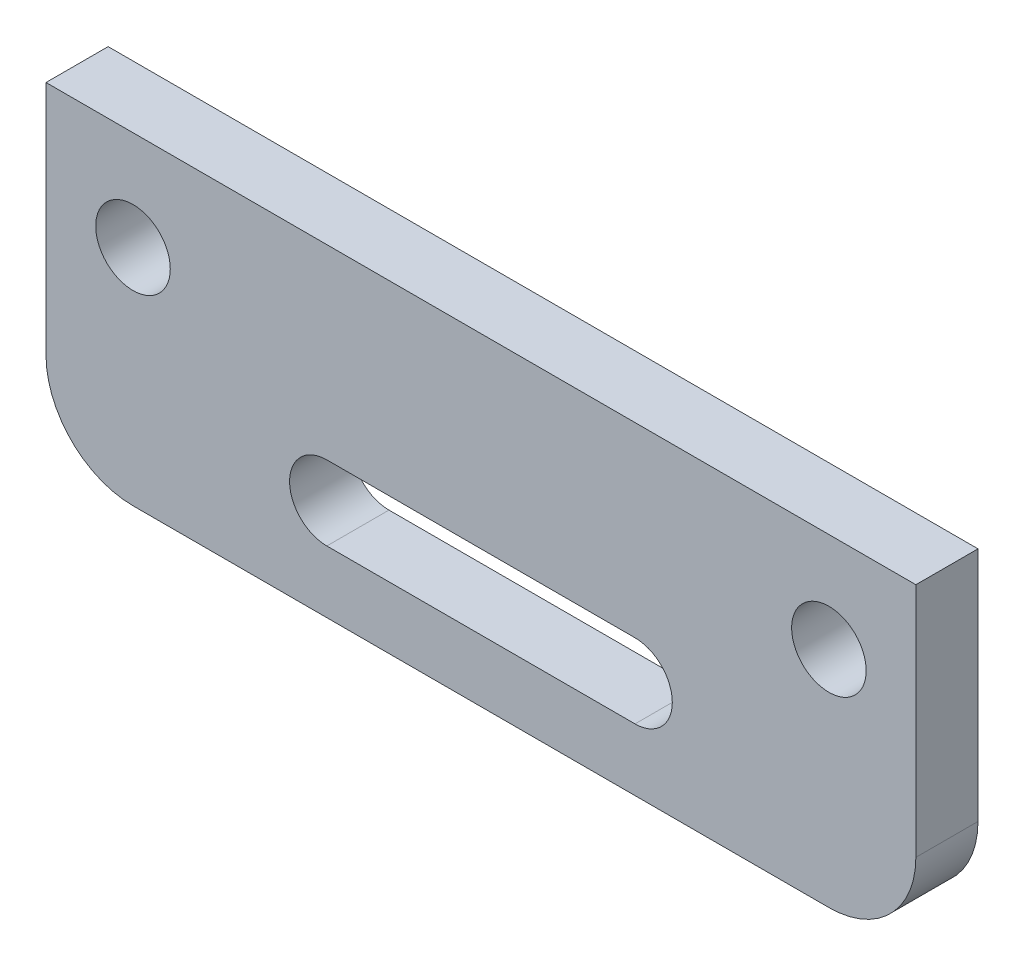
ISO-10303-21;
HEADER;
FILE_DESCRIPTION(('STEP AP214'),'2;1');
FILE_NAME('part.step','',(''),(''),'','','');
FILE_SCHEMA(('AUTOMOTIVE_DESIGN { 1 0 10303 214 1 1 1 1 }'));
ENDSEC;
DATA;
#1=APPLICATION_CONTEXT('core data for automotive mechanical design processes');
#2=APPLICATION_PROTOCOL_DEFINITION('international standard','automotive_design',2000,#1);
#3=PRODUCT_CONTEXT('',#1,'mechanical');
#4=PRODUCT('Part','Part','',(#3));
#5=PRODUCT_RELATED_PRODUCT_CATEGORY('part','',(#4));
#6=PRODUCT_DEFINITION_FORMATION('','',#4);
#7=PRODUCT_DEFINITION_CONTEXT('part definition',#1,'design');
#8=PRODUCT_DEFINITION('design','',#6,#7);
#9=PRODUCT_DEFINITION_SHAPE('','',#8);
#10=(LENGTH_UNIT() NAMED_UNIT(*) SI_UNIT(.MILLI.,.METRE.));
#11=(NAMED_UNIT(*) PLANE_ANGLE_UNIT() SI_UNIT($,.RADIAN.));
#12=(NAMED_UNIT(*) SI_UNIT($,.STERADIAN.) SOLID_ANGLE_UNIT());
#13=UNCERTAINTY_MEASURE_WITH_UNIT(LENGTH_MEASURE(1.E-05),#10,'distance_accuracy_value','');
#14=(GEOMETRIC_REPRESENTATION_CONTEXT(3) GLOBAL_UNCERTAINTY_ASSIGNED_CONTEXT((#13)) GLOBAL_UNIT_ASSIGNED_CONTEXT((#10,
#11,#12)) REPRESENTATION_CONTEXT('',''));
#15=CARTESIAN_POINT('',(0.,0.,0.));
#16=DIRECTION('',(0.,0.,1.));
#17=DIRECTION('',(1.,0.,0.));
#18=AXIS2_PLACEMENT_3D('',#15,#16,#17);
#19=CARTESIAN_POINT('',(0.,8.49264705882353,2.5));
#20=DIRECTION('',(0.,0.,-1.));
#21=DIRECTION('',(-1.,0.,0.));
#22=AXIS2_PLACEMENT_3D('',#19,#20,#21);
#23=PLANE('',#22);
#24=CARTESIAN_POINT('',(-14.,-10.,2.5));
#25=DIRECTION('',(0.,0.,1.));
#26=DIRECTION('',(1.,0.,0.));
#27=AXIS2_PLACEMENT_3D('',#24,#25,#26);
#28=CIRCLE('',#27,1.5);
#29=CARTESIAN_POINT('',(-12.5,-10.,2.5));
#30=VERTEX_POINT('',#29);
#31=EDGE_CURVE('E169',#30,#30,#28,.T.);
#32=ORIENTED_EDGE('',*,*,#31,.F.);
#33=EDGE_LOOP('',(#32));
#34=FACE_BOUND('',#33,.T.);
#35=DIRECTION('',(0.,1.,0.));
#36=VECTOR('',#35,1.);
#37=CARTESIAN_POINT('',(17.5,9.00000000000001,2.5));
#38=LINE('',#37,#36);
#39=CARTESIAN_POINT('',(17.5,-15.5,2.5));
#40=VERTEX_POINT('',#39);
#41=CARTESIAN_POINT('',(17.5,-6.,2.5));
#42=VERTEX_POINT('',#41);
#43=EDGE_CURVE('E111',#40,#42,#38,.T.);
#44=ORIENTED_EDGE('',*,*,#43,.T.);
#45=DIRECTION('',(1.,0.,0.));
#46=VECTOR('',#45,1.);
#47=CARTESIAN_POINT('',(-11.5,-6.,2.5));
#48=LINE('',#47,#46);
#49=CARTESIAN_POINT('',(-17.5,-6.,2.5));
#50=VERTEX_POINT('',#49);
#51=EDGE_CURVE('E108',#50,#42,#48,.T.);
#52=ORIENTED_EDGE('',*,*,#51,.F.);
#53=DIRECTION('',(0.,-1.,0.));
#54=VECTOR('',#53,1.);
#55=CARTESIAN_POINT('',(-17.5,9.00000000000001,2.5));
#56=LINE('',#55,#54);
#57=CARTESIAN_POINT('',(-17.5,-15.5,2.5));
#58=VERTEX_POINT('',#57);
#59=EDGE_CURVE('E55',#50,#58,#56,.T.);
#60=ORIENTED_EDGE('',*,*,#59,.T.);
#61=CARTESIAN_POINT('',(-14.,-15.5,2.5));
#62=DIRECTION('',(0.,0.,-1.));
#63=DIRECTION('',(-1.,0.,0.));
#64=AXIS2_PLACEMENT_3D('',#61,#62,#63);
#65=CIRCLE('',#64,3.5);
#66=CARTESIAN_POINT('',(-14.,-19.,2.5));
#67=VERTEX_POINT('',#66);
#68=EDGE_CURVE('E41',#58,#67,#65,.F.);
#69=ORIENTED_EDGE('',*,*,#68,.T.);
#70=DIRECTION('',(1.,0.,0.));
#71=VECTOR('',#70,1.);
#72=CARTESIAN_POINT('',(-17.5,-19.,2.5));
#73=LINE('',#72,#71);
#74=CARTESIAN_POINT('',(14.,-19.,2.5));
#75=VERTEX_POINT('',#74);
#76=EDGE_CURVE('E129',#67,#75,#73,.T.);
#77=ORIENTED_EDGE('',*,*,#76,.T.);
#78=CARTESIAN_POINT('',(14.,-15.5,2.5));
#79=DIRECTION('',(0.,0.,-1.));
#80=DIRECTION('',(-1.,0.,0.));
#81=AXIS2_PLACEMENT_3D('',#78,#79,#80);
#82=CIRCLE('',#81,3.5);
#83=EDGE_CURVE('E48',#75,#40,#82,.F.);
#84=ORIENTED_EDGE('',*,*,#83,.T.);
#85=EDGE_LOOP('',(#44,#52,#60,#69,#77,#84));
#86=FACE_BOUND('',#85,.T.);
#87=CARTESIAN_POINT('',(-6.2,-15.,2.5));
#88=DIRECTION('',(0.,0.,1.));
#89=DIRECTION('',(1.,0.,0.));
#90=AXIS2_PLACEMENT_3D('',#87,#88,#89);
#91=CIRCLE('',#90,1.5);
#92=CARTESIAN_POINT('',(-6.2,-13.5,2.5));
#93=VERTEX_POINT('',#92);
#94=CARTESIAN_POINT('',(-6.2,-16.5,2.5));
#95=VERTEX_POINT('',#94);
#96=EDGE_CURVE('E179',#93,#95,#91,.T.);
#97=ORIENTED_EDGE('',*,*,#96,.F.);
#98=DIRECTION('',(-1.,0.,0.));
#99=VECTOR('',#98,1.);
#100=CARTESIAN_POINT('',(-6.2,-13.5,2.5));
#101=LINE('',#100,#99);
#102=CARTESIAN_POINT('',(6.2,-13.5,2.5));
#103=VERTEX_POINT('',#102);
#104=EDGE_CURVE('E187',#103,#93,#101,.T.);
#105=ORIENTED_EDGE('',*,*,#104,.F.);
#106=CARTESIAN_POINT('',(6.2,-15.,2.5));
#107=DIRECTION('',(0.,0.,1.));
#108=DIRECTION('',(1.,0.,0.));
#109=AXIS2_PLACEMENT_3D('',#106,#107,#108);
#110=CIRCLE('',#109,1.5);
#111=CARTESIAN_POINT('',(6.2,-16.5,2.5));
#112=VERTEX_POINT('',#111);
#113=EDGE_CURVE('E184',#112,#103,#110,.T.);
#114=ORIENTED_EDGE('',*,*,#113,.F.);
#115=DIRECTION('',(1.,0.,0.));
#116=VECTOR('',#115,1.);
#117=CARTESIAN_POINT('',(-6.2,-16.5,2.5));
#118=LINE('',#117,#116);
#119=EDGE_CURVE('E181',#95,#112,#118,.T.);
#120=ORIENTED_EDGE('',*,*,#119,.F.);
#121=EDGE_LOOP('',(#97,#105,#114,#120));
#122=FACE_BOUND('',#121,.T.);
#123=CARTESIAN_POINT('',(14.,-10.,2.5));
#124=DIRECTION('',(0.,0.,1.));
#125=DIRECTION('',(-1.,0.,0.));
#126=AXIS2_PLACEMENT_3D('',#123,#124,#125);
#127=CIRCLE('',#126,1.5);
#128=CARTESIAN_POINT('',(12.5,-10.,2.5));
#129=VERTEX_POINT('',#128);
#130=EDGE_CURVE('E173',#129,#129,#127,.T.);
#131=ORIENTED_EDGE('',*,*,#130,.F.);
#132=EDGE_LOOP('',(#131));
#133=FACE_BOUND('',#132,.T.);
#134=ADVANCED_FACE('F33',(#34,#86,#122,#133),#23,.F.);
#135=CARTESIAN_POINT('',(0.,8.49264705882353,0.));
#136=DIRECTION('',(0.,0.,-1.));
#137=DIRECTION('',(-1.,0.,0.));
#138=AXIS2_PLACEMENT_3D('',#135,#136,#137);
#139=PLANE('',#138);
#140=DIRECTION('',(1.,0.,0.));
#141=VECTOR('',#140,1.);
#142=CARTESIAN_POINT('',(-11.5,-6.,0.));
#143=LINE('',#142,#141);
#144=CARTESIAN_POINT('',(-17.5,-6.,0.));
#145=VERTEX_POINT('',#144);
#146=CARTESIAN_POINT('',(17.5,-6.,0.));
#147=VERTEX_POINT('',#146);
#148=EDGE_CURVE('E116',#145,#147,#143,.T.);
#149=ORIENTED_EDGE('',*,*,#148,.T.);
#150=DIRECTION('',(0.,1.,0.));
#151=VECTOR('',#150,1.);
#152=CARTESIAN_POINT('',(17.5,9.00000000000001,0.));
#153=LINE('',#152,#151);
#154=CARTESIAN_POINT('',(17.5,-15.5,0.));
#155=VERTEX_POINT('',#154);
#156=EDGE_CURVE('E130',#155,#147,#153,.T.);
#157=ORIENTED_EDGE('',*,*,#156,.F.);
#158=CARTESIAN_POINT('',(14.,-15.5,0.));
#159=DIRECTION('',(0.,0.,-1.));
#160=DIRECTION('',(-1.,0.,0.));
#161=AXIS2_PLACEMENT_3D('',#158,#159,#160);
#162=CIRCLE('',#161,3.5);
#163=CARTESIAN_POINT('',(14.,-19.,0.));
#164=VERTEX_POINT('',#163);
#165=EDGE_CURVE('E147',#155,#164,#162,.T.);
#166=ORIENTED_EDGE('',*,*,#165,.T.);
#167=DIRECTION('',(1.,0.,0.));
#168=VECTOR('',#167,1.);
#169=CARTESIAN_POINT('',(-17.5,-19.,0.));
#170=LINE('',#169,#168);
#171=CARTESIAN_POINT('',(-14.,-19.,0.));
#172=VERTEX_POINT('',#171);
#173=EDGE_CURVE('E134',#172,#164,#170,.T.);
#174=ORIENTED_EDGE('',*,*,#173,.F.);
#175=CARTESIAN_POINT('',(-14.,-15.5,0.));
#176=DIRECTION('',(0.,0.,-1.));
#177=DIRECTION('',(-1.,0.,0.));
#178=AXIS2_PLACEMENT_3D('',#175,#176,#177);
#179=CIRCLE('',#178,3.5);
#180=CARTESIAN_POINT('',(-17.5,-15.5,0.));
#181=VERTEX_POINT('',#180);
#182=EDGE_CURVE('E149',#172,#181,#179,.T.);
#183=ORIENTED_EDGE('',*,*,#182,.T.);
#184=DIRECTION('',(0.,-1.,0.));
#185=VECTOR('',#184,1.);
#186=CARTESIAN_POINT('',(-17.5,9.00000000000001,0.));
#187=LINE('',#186,#185);
#188=EDGE_CURVE('E115',#145,#181,#187,.T.);
#189=ORIENTED_EDGE('',*,*,#188,.F.);
#190=EDGE_LOOP('',(#149,#157,#166,#174,#183,#189));
#191=FACE_BOUND('',#190,.T.);
#192=CARTESIAN_POINT('',(-14.,-10.,0.));
#193=DIRECTION('',(0.,0.,1.));
#194=DIRECTION('',(1.,0.,0.));
#195=AXIS2_PLACEMENT_3D('',#192,#193,#194);
#196=CIRCLE('',#195,1.5);
#197=CARTESIAN_POINT('',(-12.5,-10.,0.));
#198=VERTEX_POINT('',#197);
#199=EDGE_CURVE('E209',#198,#198,#196,.T.);
#200=ORIENTED_EDGE('',*,*,#199,.T.);
#201=EDGE_LOOP('',(#200));
#202=FACE_BOUND('',#201,.T.);
#203=DIRECTION('',(-1.,0.,0.));
#204=VECTOR('',#203,1.);
#205=CARTESIAN_POINT('',(-6.2,-13.5,0.));
#206=LINE('',#205,#204);
#207=CARTESIAN_POINT('',(6.2,-13.5,0.));
#208=VERTEX_POINT('',#207);
#209=CARTESIAN_POINT('',(-6.2,-13.5,0.));
#210=VERTEX_POINT('',#209);
#211=EDGE_CURVE('E182',#208,#210,#206,.T.);
#212=ORIENTED_EDGE('',*,*,#211,.T.);
#213=CARTESIAN_POINT('',(-6.2,-15.,0.));
#214=DIRECTION('',(0.,0.,1.));
#215=DIRECTION('',(1.,0.,0.));
#216=AXIS2_PLACEMENT_3D('',#213,#214,#215);
#217=CIRCLE('',#216,1.5);
#218=CARTESIAN_POINT('',(-6.2,-16.5,0.));
#219=VERTEX_POINT('',#218);
#220=EDGE_CURVE('E177',#210,#219,#217,.T.);
#221=ORIENTED_EDGE('',*,*,#220,.T.);
#222=DIRECTION('',(1.,0.,0.));
#223=VECTOR('',#222,1.);
#224=CARTESIAN_POINT('',(-6.2,-16.5,0.));
#225=LINE('',#224,#223);
#226=CARTESIAN_POINT('',(6.2,-16.5,0.));
#227=VERTEX_POINT('',#226);
#228=EDGE_CURVE('E192',#219,#227,#225,.T.);
#229=ORIENTED_EDGE('',*,*,#228,.T.);
#230=CARTESIAN_POINT('',(6.2,-15.,0.));
#231=DIRECTION('',(0.,0.,1.));
#232=DIRECTION('',(1.,0.,0.));
#233=AXIS2_PLACEMENT_3D('',#230,#231,#232);
#234=CIRCLE('',#233,1.5);
#235=EDGE_CURVE('E195',#227,#208,#234,.T.);
#236=ORIENTED_EDGE('',*,*,#235,.T.);
#237=EDGE_LOOP('',(#212,#221,#229,#236));
#238=FACE_BOUND('',#237,.T.);
#239=CARTESIAN_POINT('',(14.,-10.,0.));
#240=DIRECTION('',(0.,0.,1.));
#241=DIRECTION('',(-1.,0.,0.));
#242=AXIS2_PLACEMENT_3D('',#239,#240,#241);
#243=CIRCLE('',#242,1.5);
#244=CARTESIAN_POINT('',(12.5,-10.,0.));
#245=VERTEX_POINT('',#244);
#246=EDGE_CURVE('E170',#245,#245,#243,.T.);
#247=ORIENTED_EDGE('',*,*,#246,.T.);
#248=EDGE_LOOP('',(#247));
#249=FACE_BOUND('',#248,.T.);
#250=ADVANCED_FACE('F162',(#191,#202,#238,#249),#139,.T.);
#251=CARTESIAN_POINT('',(-17.5,9.00000000000001,2.5));
#252=DIRECTION('',(1.,0.,0.));
#253=DIRECTION('',(0.,1.,0.));
#254=AXIS2_PLACEMENT_3D('',#251,#252,#253);
#255=PLANE('',#254);
#256=ORIENTED_EDGE('',*,*,#59,.F.);
#257=DIRECTION('',(0.,0.,-1.));
#258=VECTOR('',#257,1.);
#259=CARTESIAN_POINT('',(-17.5,-6.,2.5));
#260=LINE('',#259,#258);
#261=EDGE_CURVE('E119',#50,#145,#260,.T.);
#262=ORIENTED_EDGE('',*,*,#261,.T.);
#263=ORIENTED_EDGE('',*,*,#188,.T.);
#264=DIRECTION('',(0.,0.,-1.));
#265=VECTOR('',#264,1.);
#266=CARTESIAN_POINT('',(-17.5,-15.5,2.5));
#267=LINE('',#266,#265);
#268=EDGE_CURVE('E127',#181,#58,#267,.F.);
#269=ORIENTED_EDGE('',*,*,#268,.T.);
#270=EDGE_LOOP('',(#256,#262,#263,#269));
#271=FACE_BOUND('',#270,.T.);
#272=ADVANCED_FACE('F125',(#271),#255,.F.);
#273=CARTESIAN_POINT('',(-17.5,-19.,2.5));
#274=DIRECTION('',(0.,1.,0.));
#275=DIRECTION('',(-1.,0.,0.));
#276=AXIS2_PLACEMENT_3D('',#273,#274,#275);
#277=PLANE('',#276);
#278=ORIENTED_EDGE('',*,*,#76,.F.);
#279=DIRECTION('',(0.,0.,-1.));
#280=VECTOR('',#279,1.);
#281=CARTESIAN_POINT('',(-14.,-19.,2.5));
#282=LINE('',#281,#280);
#283=EDGE_CURVE('E144',#67,#172,#282,.T.);
#284=ORIENTED_EDGE('',*,*,#283,.T.);
#285=ORIENTED_EDGE('',*,*,#173,.T.);
#286=DIRECTION('',(0.,0.,-1.));
#287=VECTOR('',#286,1.);
#288=CARTESIAN_POINT('',(14.,-19.,2.5));
#289=LINE('',#288,#287);
#290=EDGE_CURVE('E139',#164,#75,#289,.F.);
#291=ORIENTED_EDGE('',*,*,#290,.T.);
#292=EDGE_LOOP('',(#278,#284,#285,#291));
#293=FACE_BOUND('',#292,.T.);
#294=ADVANCED_FACE('F157',(#293),#277,.F.);
#295=CARTESIAN_POINT('',(17.5,9.00000000000001,2.5));
#296=DIRECTION('',(-1.,0.,0.));
#297=DIRECTION('',(0.,-1.,0.));
#298=AXIS2_PLACEMENT_3D('',#295,#296,#297);
#299=PLANE('',#298);
#300=ORIENTED_EDGE('',*,*,#156,.T.);
#301=DIRECTION('',(0.,0.,1.));
#302=VECTOR('',#301,1.);
#303=CARTESIAN_POINT('',(17.5,-6.,2.5));
#304=LINE('',#303,#302);
#305=EDGE_CURVE('E123',#147,#42,#304,.T.);
#306=ORIENTED_EDGE('',*,*,#305,.T.);
#307=ORIENTED_EDGE('',*,*,#43,.F.);
#308=DIRECTION('',(0.,0.,-1.));
#309=VECTOR('',#308,1.);
#310=CARTESIAN_POINT('',(17.5,-15.5,2.5));
#311=LINE('',#310,#309);
#312=EDGE_CURVE('E11',#40,#155,#311,.T.);
#313=ORIENTED_EDGE('',*,*,#312,.T.);
#314=EDGE_LOOP('',(#300,#306,#307,#313));
#315=FACE_BOUND('',#314,.T.);
#316=ADVANCED_FACE('F168',(#315),#299,.F.);
#317=CARTESIAN_POINT('',(-11.5,-6.,2.5));
#318=DIRECTION('',(0.,1.,0.));
#319=DIRECTION('',(0.,0.,1.));
#320=AXIS2_PLACEMENT_3D('',#317,#318,#319);
#321=PLANE('',#320);
#322=ORIENTED_EDGE('',*,*,#148,.F.);
#323=ORIENTED_EDGE('',*,*,#261,.F.);
#324=ORIENTED_EDGE('',*,*,#51,.T.);
#325=ORIENTED_EDGE('',*,*,#305,.F.);
#326=EDGE_LOOP('',(#322,#323,#324,#325));
#327=FACE_BOUND('',#326,.T.);
#328=ADVANCED_FACE('F120',(#327),#321,.T.);
#329=CARTESIAN_POINT('',(-14.,-10.,2.5));
#330=DIRECTION('',(0.,0.,-1.));
#331=DIRECTION('',(-1.,0.,0.));
#332=AXIS2_PLACEMENT_3D('',#329,#330,#331);
#333=CYLINDRICAL_SURFACE('',#332,1.5);
#334=ORIENTED_EDGE('',*,*,#31,.T.);
#335=EDGE_LOOP('',(#334));
#336=FACE_BOUND('',#335,.T.);
#337=ORIENTED_EDGE('',*,*,#199,.F.);
#338=EDGE_LOOP('',(#337));
#339=FACE_BOUND('',#338,.T.);
#340=ADVANCED_FACE('F216',(#336,#339),#333,.F.);
#341=CARTESIAN_POINT('',(-6.2,-15.,2.5));
#342=DIRECTION('',(0.,0.,-1.));
#343=DIRECTION('',(-1.,0.,0.));
#344=AXIS2_PLACEMENT_3D('',#341,#342,#343);
#345=CYLINDRICAL_SURFACE('',#344,1.5);
#346=ORIENTED_EDGE('',*,*,#220,.F.);
#347=DIRECTION('',(0.,0.,-1.));
#348=VECTOR('',#347,1.);
#349=CARTESIAN_POINT('',(-6.2,-13.5,2.5));
#350=LINE('',#349,#348);
#351=EDGE_CURVE('E189',#93,#210,#350,.T.);
#352=ORIENTED_EDGE('',*,*,#351,.F.);
#353=ORIENTED_EDGE('',*,*,#96,.T.);
#354=DIRECTION('',(0.,0.,-1.));
#355=VECTOR('',#354,1.);
#356=CARTESIAN_POINT('',(-6.2,-16.5,2.5));
#357=LINE('',#356,#355);
#358=EDGE_CURVE('E206',#95,#219,#357,.T.);
#359=ORIENTED_EDGE('',*,*,#358,.T.);
#360=EDGE_LOOP('',(#346,#352,#353,#359));
#361=FACE_BOUND('',#360,.T.);
#362=ADVANCED_FACE('F218',(#361),#345,.F.);
#363=CARTESIAN_POINT('',(-6.2,-16.5,2.5));
#364=DIRECTION('',(0.,1.,0.));
#365=DIRECTION('',(0.,0.,1.));
#366=AXIS2_PLACEMENT_3D('',#363,#364,#365);
#367=PLANE('',#366);
#368=ORIENTED_EDGE('',*,*,#228,.F.);
#369=ORIENTED_EDGE('',*,*,#358,.F.);
#370=ORIENTED_EDGE('',*,*,#119,.T.);
#371=DIRECTION('',(0.,0.,-1.));
#372=VECTOR('',#371,1.);
#373=CARTESIAN_POINT('',(6.2,-16.5,2.5));
#374=LINE('',#373,#372);
#375=EDGE_CURVE('E204',#112,#227,#374,.T.);
#376=ORIENTED_EDGE('',*,*,#375,.T.);
#377=EDGE_LOOP('',(#368,#369,#370,#376));
#378=FACE_BOUND('',#377,.T.);
#379=ADVANCED_FACE('F225',(#378),#367,.T.);
#380=CARTESIAN_POINT('',(6.2,-15.,2.5));
#381=DIRECTION('',(0.,0.,-1.));
#382=DIRECTION('',(-1.,0.,0.));
#383=AXIS2_PLACEMENT_3D('',#380,#381,#382);
#384=CYLINDRICAL_SURFACE('',#383,1.5);
#385=ORIENTED_EDGE('',*,*,#235,.F.);
#386=ORIENTED_EDGE('',*,*,#375,.F.);
#387=ORIENTED_EDGE('',*,*,#113,.T.);
#388=DIRECTION('',(0.,0.,-1.));
#389=VECTOR('',#388,1.);
#390=CARTESIAN_POINT('',(6.2,-13.5,2.5));
#391=LINE('',#390,#389);
#392=EDGE_CURVE('E202',#103,#208,#391,.T.);
#393=ORIENTED_EDGE('',*,*,#392,.T.);
#394=EDGE_LOOP('',(#385,#386,#387,#393));
#395=FACE_BOUND('',#394,.T.);
#396=ADVANCED_FACE('F255',(#395),#384,.F.);
#397=CARTESIAN_POINT('',(-6.2,-13.5,2.5));
#398=DIRECTION('',(0.,-1.,0.));
#399=DIRECTION('',(0.,0.,-1.));
#400=AXIS2_PLACEMENT_3D('',#397,#398,#399);
#401=PLANE('',#400);
#402=ORIENTED_EDGE('',*,*,#211,.F.);
#403=ORIENTED_EDGE('',*,*,#392,.F.);
#404=ORIENTED_EDGE('',*,*,#104,.T.);
#405=ORIENTED_EDGE('',*,*,#351,.T.);
#406=EDGE_LOOP('',(#402,#403,#404,#405));
#407=FACE_BOUND('',#406,.T.);
#408=ADVANCED_FACE('F249',(#407),#401,.T.);
#409=CARTESIAN_POINT('',(14.,-10.,2.5));
#410=DIRECTION('',(0.,0.,-1.));
#411=DIRECTION('',(-1.,0.,0.));
#412=AXIS2_PLACEMENT_3D('',#409,#410,#411);
#413=CYLINDRICAL_SURFACE('',#412,1.5);
#414=ORIENTED_EDGE('',*,*,#130,.T.);
#415=EDGE_LOOP('',(#414));
#416=FACE_BOUND('',#415,.T.);
#417=ORIENTED_EDGE('',*,*,#246,.F.);
#418=EDGE_LOOP('',(#417));
#419=FACE_BOUND('',#418,.T.);
#420=ADVANCED_FACE('F244',(#416,#419),#413,.F.);
#421=CARTESIAN_POINT('',(-14.,-15.5,2.5));
#422=DIRECTION('',(0.,0.,-1.));
#423=DIRECTION('',(-1.,0.,0.));
#424=AXIS2_PLACEMENT_3D('',#421,#422,#423);
#425=CYLINDRICAL_SURFACE('',#424,3.5);
#426=ORIENTED_EDGE('',*,*,#68,.F.);
#427=ORIENTED_EDGE('',*,*,#268,.F.);
#428=ORIENTED_EDGE('',*,*,#182,.F.);
#429=ORIENTED_EDGE('',*,*,#283,.F.);
#430=EDGE_LOOP('',(#426,#427,#428,#429));
#431=FACE_BOUND('',#430,.T.);
#432=ADVANCED_FACE('F160',(#431),#425,.T.);
#433=CARTESIAN_POINT('',(14.,-15.5,2.5));
#434=DIRECTION('',(0.,0.,-1.));
#435=DIRECTION('',(-1.,0.,0.));
#436=AXIS2_PLACEMENT_3D('',#433,#434,#435);
#437=CYLINDRICAL_SURFACE('',#436,3.5);
#438=ORIENTED_EDGE('',*,*,#83,.F.);
#439=ORIENTED_EDGE('',*,*,#290,.F.);
#440=ORIENTED_EDGE('',*,*,#165,.F.);
#441=ORIENTED_EDGE('',*,*,#312,.F.);
#442=EDGE_LOOP('',(#438,#439,#440,#441));
#443=FACE_BOUND('',#442,.T.);
#444=ADVANCED_FACE('F35',(#443),#437,.T.);
#445=CLOSED_SHELL('',(#134,#250,#272,#294,#316,#328,#340,#362,#379,#396,#408,#420,#432,#444));
#446=MANIFOLD_SOLID_BREP('B2',#445);
#447=ADVANCED_BREP_SHAPE_REPRESENTATION('',(#18,#446),#14);
#448=SHAPE_DEFINITION_REPRESENTATION(#9,#447);
ENDSEC;
END-ISO-10303-21;
